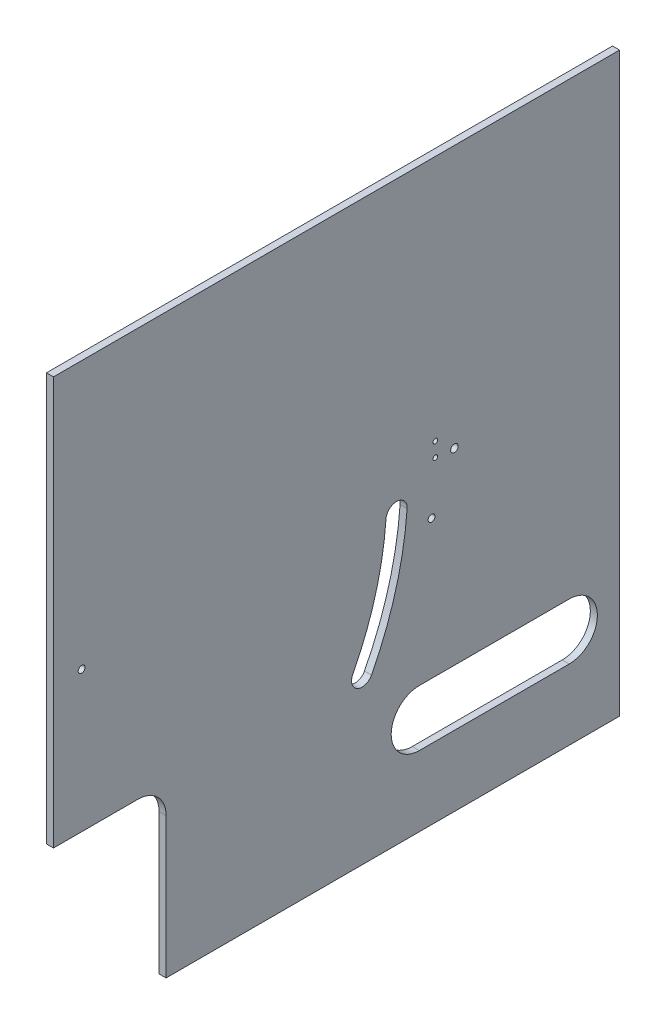
ISO-10303-21;
HEADER;
FILE_DESCRIPTION(('STEP AP214'),'2;1');
FILE_NAME('part.step','',(''),(''),'','','');
FILE_SCHEMA(('AUTOMOTIVE_DESIGN { 1 0 10303 214 1 1 1 1 }'));
ENDSEC;
DATA;
#1=APPLICATION_CONTEXT('core data for automotive mechanical design processes');
#2=APPLICATION_PROTOCOL_DEFINITION('international standard','automotive_design',2000,#1);
#3=PRODUCT_CONTEXT('',#1,'mechanical');
#4=PRODUCT('Part','Part','',(#3));
#5=PRODUCT_RELATED_PRODUCT_CATEGORY('part','',(#4));
#6=PRODUCT_DEFINITION_FORMATION('','',#4);
#7=PRODUCT_DEFINITION_CONTEXT('part definition',#1,'design');
#8=PRODUCT_DEFINITION('design','',#6,#7);
#9=PRODUCT_DEFINITION_SHAPE('','',#8);
#10=(LENGTH_UNIT() NAMED_UNIT(*) SI_UNIT(.MILLI.,.METRE.));
#11=(NAMED_UNIT(*) PLANE_ANGLE_UNIT() SI_UNIT($,.RADIAN.));
#12=(NAMED_UNIT(*) SI_UNIT($,.STERADIAN.) SOLID_ANGLE_UNIT());
#13=UNCERTAINTY_MEASURE_WITH_UNIT(LENGTH_MEASURE(1.E-05),#10,'distance_accuracy_value','');
#14=(GEOMETRIC_REPRESENTATION_CONTEXT(3) GLOBAL_UNCERTAINTY_ASSIGNED_CONTEXT((#13)) GLOBAL_UNIT_ASSIGNED_CONTEXT((#10,
#11,#12)) REPRESENTATION_CONTEXT('',''));
#15=CARTESIAN_POINT('',(0.,0.,0.));
#16=DIRECTION('',(0.,0.,1.));
#17=DIRECTION('',(1.,0.,0.));
#18=AXIS2_PLACEMENT_3D('',#15,#16,#17);
#19=CARTESIAN_POINT('',(3.175,130.175,127.725));
#20=DIRECTION('',(0.,0.,-1.));
#21=DIRECTION('',(-1.,0.,0.));
#22=AXIS2_PLACEMENT_3D('',#19,#20,#21);
#23=PLANE('',#22);
#24=DIRECTION('',(0.,-1.,0.));
#25=VECTOR('',#24,1.);
#26=CARTESIAN_POINT('',(0.,130.175,127.725));
#27=LINE('',#26,#25);
#28=CARTESIAN_POINT('',(0.,130.175,127.725));
#29=VERTEX_POINT('',#28);
#30=CARTESIAN_POINT('',(0.,-53.975,127.725));
#31=VERTEX_POINT('',#30);
#32=EDGE_CURVE('E254',#29,#31,#27,.T.);
#33=ORIENTED_EDGE('',*,*,#32,.T.);
#34=DIRECTION('',(-1.,0.,0.));
#35=VECTOR('',#34,1.);
#36=CARTESIAN_POINT('',(3.175,-53.975,127.725));
#37=LINE('',#36,#35);
#38=CARTESIAN_POINT('',(3.175,-53.975,127.725));
#39=VERTEX_POINT('',#38);
#40=EDGE_CURVE('E184',#39,#31,#37,.T.);
#41=ORIENTED_EDGE('',*,*,#40,.F.);
#42=DIRECTION('',(0.,-1.,0.));
#43=VECTOR('',#42,1.);
#44=CARTESIAN_POINT('',(3.175,130.175,127.725));
#45=LINE('',#44,#43);
#46=CARTESIAN_POINT('',(3.175,130.175,127.725));
#47=VERTEX_POINT('',#46);
#48=EDGE_CURVE('E255',#47,#39,#45,.T.);
#49=ORIENTED_EDGE('',*,*,#48,.F.);
#50=DIRECTION('',(-1.,0.,0.));
#51=VECTOR('',#50,1.);
#52=CARTESIAN_POINT('',(3.175,130.175,127.725));
#53=LINE('',#52,#51);
#54=EDGE_CURVE('E263',#47,#29,#53,.T.);
#55=ORIENTED_EDGE('',*,*,#54,.T.);
#56=EDGE_LOOP('',(#33,#41,#49,#55));
#57=FACE_BOUND('',#56,.T.);
#58=ADVANCED_FACE('F35',(#57),#23,.F.);
#59=CARTESIAN_POINT('',(3.175,-130.175,127.725));
#60=DIRECTION('',(0.,1.,0.));
#61=DIRECTION('',(0.,0.,1.));
#62=AXIS2_PLACEMENT_3D('',#59,#60,#61);
#63=PLANE('',#62);
#64=DIRECTION('',(0.,0.,-1.));
#65=VECTOR('',#64,1.);
#66=CARTESIAN_POINT('',(3.175,-130.175,127.725));
#67=LINE('',#66,#65);
#68=CARTESIAN_POINT('',(3.175,-130.175,76.9250000000001));
#69=VERTEX_POINT('',#68);
#70=CARTESIAN_POINT('',(3.175,-130.175,-127.725));
#71=VERTEX_POINT('',#70);
#72=EDGE_CURVE('E258',#69,#71,#67,.T.);
#73=ORIENTED_EDGE('',*,*,#72,.F.);
#74=DIRECTION('',(-1.,0.,0.));
#75=VECTOR('',#74,1.);
#76=CARTESIAN_POINT('',(3.175,-130.175,76.9250000000001));
#77=LINE('',#76,#75);
#78=CARTESIAN_POINT('',(0.,-130.175,76.9250000000001));
#79=VERTEX_POINT('',#78);
#80=EDGE_CURVE('E188',#69,#79,#77,.T.);
#81=ORIENTED_EDGE('',*,*,#80,.T.);
#82=DIRECTION('',(0.,0.,-1.));
#83=VECTOR('',#82,1.);
#84=CARTESIAN_POINT('',(0.,-130.175,127.725));
#85=LINE('',#84,#83);
#86=CARTESIAN_POINT('',(0.,-130.175,-127.725));
#87=VERTEX_POINT('',#86);
#88=EDGE_CURVE('E266',#79,#87,#85,.T.);
#89=ORIENTED_EDGE('',*,*,#88,.T.);
#90=DIRECTION('',(-1.,0.,0.));
#91=VECTOR('',#90,1.);
#92=CARTESIAN_POINT('',(3.175,-130.175,-127.725));
#93=LINE('',#92,#91);
#94=EDGE_CURVE('E276',#71,#87,#93,.T.);
#95=ORIENTED_EDGE('',*,*,#94,.F.);
#96=EDGE_LOOP('',(#73,#81,#89,#95));
#97=FACE_BOUND('',#96,.T.);
#98=ADVANCED_FACE('F304',(#97),#63,.F.);
#99=CARTESIAN_POINT('',(3.175,130.175,-127.725));
#100=DIRECTION('',(0.,0.,1.));
#101=DIRECTION('',(0.,-1.,0.));
#102=AXIS2_PLACEMENT_3D('',#99,#100,#101);
#103=PLANE('',#102);
#104=DIRECTION('',(-1.,0.,0.));
#105=VECTOR('',#104,1.);
#106=CARTESIAN_POINT('',(3.175,130.175,-127.725));
#107=LINE('',#106,#105);
#108=CARTESIAN_POINT('',(3.175,130.175,-127.725));
#109=VERTEX_POINT('',#108);
#110=CARTESIAN_POINT('',(0.,130.175,-127.725));
#111=VERTEX_POINT('',#110);
#112=EDGE_CURVE('E274',#109,#111,#107,.T.);
#113=ORIENTED_EDGE('',*,*,#112,.F.);
#114=DIRECTION('',(0.,1.,0.));
#115=VECTOR('',#114,1.);
#116=CARTESIAN_POINT('',(3.175,130.175,-127.725));
#117=LINE('',#116,#115);
#118=EDGE_CURVE('E261',#71,#109,#117,.T.);
#119=ORIENTED_EDGE('',*,*,#118,.F.);
#120=ORIENTED_EDGE('',*,*,#94,.T.);
#121=DIRECTION('',(0.,1.,0.));
#122=VECTOR('',#121,1.);
#123=CARTESIAN_POINT('',(0.,130.175,-127.725));
#124=LINE('',#123,#122);
#125=EDGE_CURVE('E268',#87,#111,#124,.T.);
#126=ORIENTED_EDGE('',*,*,#125,.T.);
#127=EDGE_LOOP('',(#113,#119,#120,#126));
#128=FACE_BOUND('',#127,.T.);
#129=ADVANCED_FACE('F312',(#128),#103,.F.);
#130=CARTESIAN_POINT('',(3.175,130.175,127.725));
#131=DIRECTION('',(0.,-1.,0.));
#132=DIRECTION('',(0.,0.,-1.));
#133=AXIS2_PLACEMENT_3D('',#130,#131,#132);
#134=PLANE('',#133);
#135=ORIENTED_EDGE('',*,*,#54,.F.);
#136=DIRECTION('',(0.,0.,-1.));
#137=VECTOR('',#136,1.);
#138=CARTESIAN_POINT('',(3.175,130.175,127.725));
#139=LINE('',#138,#137);
#140=EDGE_CURVE('E196',#47,#109,#139,.T.);
#141=ORIENTED_EDGE('',*,*,#140,.T.);
#142=ORIENTED_EDGE('',*,*,#112,.T.);
#143=DIRECTION('',(0.,0.,1.));
#144=VECTOR('',#143,1.);
#145=CARTESIAN_POINT('',(0.,130.175,127.725));
#146=LINE('',#145,#144);
#147=EDGE_CURVE('E259',#111,#29,#146,.T.);
#148=ORIENTED_EDGE('',*,*,#147,.T.);
#149=EDGE_LOOP('',(#135,#141,#142,#148));
#150=FACE_BOUND('',#149,.T.);
#151=ADVANCED_FACE('F311',(#150),#134,.F.);
#152=CARTESIAN_POINT('',(3.175,0.,0.));
#153=DIRECTION('',(1.,0.,0.));
#154=DIRECTION('',(0.,0.,-1.));
#155=AXIS2_PLACEMENT_3D('',#152,#153,#154);
#156=PLANE('',#155);
#157=CARTESIAN_POINT('',(3.175,9.52500000000001,115.025));
#158=DIRECTION('',(-1.,0.,0.));
#159=DIRECTION('',(0.,0.,1.));
#160=AXIS2_PLACEMENT_3D('',#157,#158,#159);
#161=CIRCLE('',#160,147.274915375813);
#162=CARTESIAN_POINT('',(3.175,-1.08849419113548,-31.8669822182528));
#163=VERTEX_POINT('',#162);
#164=CARTESIAN_POINT('',(3.175,-58.1270794828527,-15.792035743051));
#165=VERTEX_POINT('',#164);
#166=EDGE_CURVE('E143',#163,#165,#161,.T.);
#167=ORIENTED_EDGE('',*,*,#166,.T.);
#168=CARTESIAN_POINT('',(3.175,-55.9336784294285,-11.5507141724795));
#169=DIRECTION('',(-1.,0.,0.));
#170=DIRECTION('',(0.,0.,1.));
#171=AXIS2_PLACEMENT_3D('',#168,#169,#170);
#172=CIRCLE('',#171,4.77491537581112);
#173=CARTESIAN_POINT('',(3.175,-53.7402773760043,-7.30939260190796));
#174=VERTEX_POINT('',#173);
#175=EDGE_CURVE('E152',#165,#174,#172,.T.);
#176=ORIENTED_EDGE('',*,*,#175,.T.);
#177=CARTESIAN_POINT('',(3.175,9.52500000000001,115.025));
#178=DIRECTION('',(1.,0.,0.));
#179=DIRECTION('',(0.,0.,1.));
#180=AXIS2_PLACEMENT_3D('',#177,#178,#179);
#181=CIRCLE('',#180,137.725084624191);
#182=CARTESIAN_POINT('',(3.175,-0.400277376004277,-22.341982218253));
#183=VERTEX_POINT('',#182);
#184=EDGE_CURVE('E50',#174,#183,#181,.T.);
#185=ORIENTED_EDGE('',*,*,#184,.T.);
#186=CARTESIAN_POINT('',(3.175,-0.744385783569874,-27.1044822182528));
#187=DIRECTION('',(-1.,0.,0.));
#188=DIRECTION('',(0.,0.,1.));
#189=AXIS2_PLACEMENT_3D('',#186,#187,#188);
#190=CIRCLE('',#189,4.77491537581111);
#191=EDGE_CURVE('E149',#183,#163,#190,.T.);
#192=ORIENTED_EDGE('',*,*,#191,.T.);
#193=EDGE_LOOP('',(#167,#176,#185,#192));
#194=FACE_BOUND('',#193,.T.);
#195=DIRECTION('',(0.,0.,-1.));
#196=VECTOR('',#195,1.);
#197=CARTESIAN_POINT('',(3.175,-53.975,127.725));
#198=LINE('',#197,#196);
#199=CARTESIAN_POINT('',(3.175,-53.975,89.625));
#200=VERTEX_POINT('',#199);
#201=EDGE_CURVE('E178',#39,#200,#198,.T.);
#202=ORIENTED_EDGE('',*,*,#201,.T.);
#203=CARTESIAN_POINT('',(3.175,-66.675,89.625));
#204=DIRECTION('',(1.,0.,0.));
#205=DIRECTION('',(0.,0.,-1.));
#206=AXIS2_PLACEMENT_3D('',#203,#204,#205);
#207=CIRCLE('',#206,12.7);
#208=CARTESIAN_POINT('',(3.175,-66.675,76.925));
#209=VERTEX_POINT('',#208);
#210=EDGE_CURVE('E11',#200,#209,#207,.F.);
#211=ORIENTED_EDGE('',*,*,#210,.T.);
#212=DIRECTION('',(0.,-1.,0.));
#213=VECTOR('',#212,1.);
#214=CARTESIAN_POINT('',(3.175,-53.975,76.925));
#215=LINE('',#214,#213);
#216=EDGE_CURVE('E181',#209,#69,#215,.T.);
#217=ORIENTED_EDGE('',*,*,#216,.T.);
#218=ORIENTED_EDGE('',*,*,#72,.T.);
#219=ORIENTED_EDGE('',*,*,#118,.T.);
#220=ORIENTED_EDGE('',*,*,#140,.F.);
#221=ORIENTED_EDGE('',*,*,#48,.T.);
#222=EDGE_LOOP('',(#202,#211,#217,#218,#219,#220,#221));
#223=FACE_BOUND('',#222,.T.);
#224=CARTESIAN_POINT('',(3.175,9.52500000000001,115.025));
#225=DIRECTION('',(-1.,0.,0.));
#226=DIRECTION('',(0.,0.,1.));
#227=AXIS2_PLACEMENT_3D('',#224,#225,#226);
#228=CIRCLE('',#227,1.54999999999999);
#229=CARTESIAN_POINT('',(3.175,9.52500000000001,116.575));
#230=VERTEX_POINT('',#229);
#231=EDGE_CURVE('E193',#230,#230,#228,.T.);
#232=ORIENTED_EDGE('',*,*,#231,.T.);
#233=EDGE_LOOP('',(#232));
#234=FACE_BOUND('',#233,.T.);
#235=CARTESIAN_POINT('',(3.175,-10.375,-42.9049952));
#236=DIRECTION('',(-1.,0.,0.));
#237=DIRECTION('',(0.,0.,1.));
#238=AXIS2_PLACEMENT_3D('',#235,#236,#237);
#239=CIRCLE('',#238,1.54999689999999);
#240=CARTESIAN_POINT('',(3.175,-10.375,-41.3549983));
#241=VERTEX_POINT('',#240);
#242=EDGE_CURVE('E208',#241,#241,#239,.T.);
#243=ORIENTED_EDGE('',*,*,#242,.T.);
#244=EDGE_LOOP('',(#243));
#245=FACE_BOUND('',#244,.T.);
#246=CARTESIAN_POINT('',(3.175,11.825,-53.205));
#247=DIRECTION('',(-1.,0.,0.));
#248=DIRECTION('',(0.,0.,1.));
#249=AXIS2_PLACEMENT_3D('',#246,#247,#248);
#250=CIRCLE('',#249,1.69999660000001);
#251=CARTESIAN_POINT('',(3.175,11.825,-51.5050033999999));
#252=VERTEX_POINT('',#251);
#253=EDGE_CURVE('E201',#252,#252,#250,.T.);
#254=ORIENTED_EDGE('',*,*,#253,.T.);
#255=EDGE_LOOP('',(#254));
#256=FACE_BOUND('',#255,.T.);
#257=CARTESIAN_POINT('',(3.175,12.425,-44.6049999999999));
#258=DIRECTION('',(-1.,0.,0.));
#259=DIRECTION('',(0.,0.,1.));
#260=AXIS2_PLACEMENT_3D('',#257,#258,#259);
#261=CIRCLE('',#260,1.05);
#262=CARTESIAN_POINT('',(3.175,12.425,-43.5549999999999));
#263=VERTEX_POINT('',#262);
#264=EDGE_CURVE('E218',#263,#263,#261,.T.);
#265=ORIENTED_EDGE('',*,*,#264,.T.);
#266=EDGE_LOOP('',(#265));
#267=FACE_BOUND('',#266,.T.);
#268=CARTESIAN_POINT('',(3.175,18.925,-44.605));
#269=DIRECTION('',(-1.,0.,0.));
#270=DIRECTION('',(0.,0.,1.));
#271=AXIS2_PLACEMENT_3D('',#268,#269,#270);
#272=CIRCLE('',#271,1.05);
#273=CARTESIAN_POINT('',(3.175,18.925,-43.555));
#274=VERTEX_POINT('',#273);
#275=EDGE_CURVE('E200',#274,#274,#272,.T.);
#276=ORIENTED_EDGE('',*,*,#275,.T.);
#277=EDGE_LOOP('',(#276));
#278=FACE_BOUND('',#277,.T.);
#279=CARTESIAN_POINT('',(3.175,-85.725,-105.025));
#280=DIRECTION('',(1.,0.,0.));
#281=DIRECTION('',(0.,0.,-1.));
#282=AXIS2_PLACEMENT_3D('',#279,#280,#281);
#283=CIRCLE('',#282,12.7);
#284=CARTESIAN_POINT('',(3.175,-98.425,-105.025));
#285=VERTEX_POINT('',#284);
#286=CARTESIAN_POINT('',(3.175,-73.025,-105.025));
#287=VERTEX_POINT('',#286);
#288=EDGE_CURVE('E252',#285,#287,#283,.T.);
#289=ORIENTED_EDGE('',*,*,#288,.F.);
#290=DIRECTION('',(0.,0.,-1.));
#291=VECTOR('',#290,1.);
#292=CARTESIAN_POINT('',(3.175,-98.425,0.));
#293=LINE('',#292,#291);
#294=CARTESIAN_POINT('',(3.175,-98.425,-37.3749999999999));
#295=VERTEX_POINT('',#294);
#296=EDGE_CURVE('E239',#295,#285,#293,.T.);
#297=ORIENTED_EDGE('',*,*,#296,.F.);
#298=CARTESIAN_POINT('',(3.175,-85.725,-37.3749999999999));
#299=DIRECTION('',(1.,0.,0.));
#300=DIRECTION('',(0.,0.,-1.));
#301=AXIS2_PLACEMENT_3D('',#298,#299,#300);
#302=CIRCLE('',#301,12.7);
#303=CARTESIAN_POINT('',(3.175,-73.025,-37.3749999999999));
#304=VERTEX_POINT('',#303);
#305=EDGE_CURVE('E247',#304,#295,#302,.T.);
#306=ORIENTED_EDGE('',*,*,#305,.F.);
#307=DIRECTION('',(0.,0.,1.));
#308=VECTOR('',#307,1.);
#309=CARTESIAN_POINT('',(3.175,-73.025,0.));
#310=LINE('',#309,#308);
#311=EDGE_CURVE('E250',#287,#304,#310,.T.);
#312=ORIENTED_EDGE('',*,*,#311,.F.);
#313=EDGE_LOOP('',(#289,#297,#306,#312));
#314=FACE_BOUND('',#313,.T.);
#315=ADVANCED_FACE('F156',(#194,#223,#234,#245,#256,#267,#278,#314),#156,.T.);
#316=CARTESIAN_POINT('',(0.,0.,0.));
#317=DIRECTION('',(1.,0.,0.));
#318=DIRECTION('',(0.,0.,-1.));
#319=AXIS2_PLACEMENT_3D('',#316,#317,#318);
#320=PLANE('',#319);
#321=CARTESIAN_POINT('',(0.,-55.9336784294285,-11.5507141724795));
#322=DIRECTION('',(-1.,0.,0.));
#323=DIRECTION('',(0.,0.,1.));
#324=AXIS2_PLACEMENT_3D('',#321,#322,#323);
#325=CIRCLE('',#324,4.77491537581112);
#326=CARTESIAN_POINT('',(0.,-58.1270794828527,-15.792035743051));
#327=VERTEX_POINT('',#326);
#328=CARTESIAN_POINT('',(0.,-53.7402773760043,-7.30939260190796));
#329=VERTEX_POINT('',#328);
#330=EDGE_CURVE('E168',#327,#329,#325,.T.);
#331=ORIENTED_EDGE('',*,*,#330,.F.);
#332=CARTESIAN_POINT('',(0.,9.52500000000001,115.025));
#333=DIRECTION('',(-1.,0.,0.));
#334=DIRECTION('',(0.,0.,1.));
#335=AXIS2_PLACEMENT_3D('',#332,#333,#334);
#336=CIRCLE('',#335,147.274915375813);
#337=CARTESIAN_POINT('',(0.,-1.08849419113548,-31.8669822182528));
#338=VERTEX_POINT('',#337);
#339=EDGE_CURVE('E58',#338,#327,#336,.T.);
#340=ORIENTED_EDGE('',*,*,#339,.F.);
#341=CARTESIAN_POINT('',(0.,-0.744385783569874,-27.1044822182528));
#342=DIRECTION('',(-1.,0.,0.));
#343=DIRECTION('',(0.,0.,1.));
#344=AXIS2_PLACEMENT_3D('',#341,#342,#343);
#345=CIRCLE('',#344,4.77491537581111);
#346=CARTESIAN_POINT('',(0.,-0.400277376004277,-22.341982218253));
#347=VERTEX_POINT('',#346);
#348=EDGE_CURVE('E159',#347,#338,#345,.T.);
#349=ORIENTED_EDGE('',*,*,#348,.F.);
#350=CARTESIAN_POINT('',(0.,9.52500000000001,115.025));
#351=DIRECTION('',(1.,0.,0.));
#352=DIRECTION('',(0.,0.,1.));
#353=AXIS2_PLACEMENT_3D('',#350,#351,#352);
#354=CIRCLE('',#353,137.725084624191);
#355=EDGE_CURVE('E162',#329,#347,#354,.T.);
#356=ORIENTED_EDGE('',*,*,#355,.F.);
#357=EDGE_LOOP('',(#331,#340,#349,#356));
#358=FACE_BOUND('',#357,.T.);
#359=CARTESIAN_POINT('',(0.,9.52500000000001,115.025));
#360=DIRECTION('',(-1.,0.,0.));
#361=DIRECTION('',(0.,0.,1.));
#362=AXIS2_PLACEMENT_3D('',#359,#360,#361);
#363=CIRCLE('',#362,1.54999999999999);
#364=CARTESIAN_POINT('',(0.,9.52500000000001,116.575));
#365=VERTEX_POINT('',#364);
#366=EDGE_CURVE('E197',#365,#365,#363,.T.);
#367=ORIENTED_EDGE('',*,*,#366,.F.);
#368=EDGE_LOOP('',(#367));
#369=FACE_BOUND('',#368,.T.);
#370=CARTESIAN_POINT('',(0.,-10.375,-42.9049952));
#371=DIRECTION('',(-1.,0.,0.));
#372=DIRECTION('',(0.,0.,1.));
#373=AXIS2_PLACEMENT_3D('',#370,#371,#372);
#374=CIRCLE('',#373,1.54999689999999);
#375=CARTESIAN_POINT('',(0.,-10.375,-41.3549983));
#376=VERTEX_POINT('',#375);
#377=EDGE_CURVE('E191',#376,#376,#374,.T.);
#378=ORIENTED_EDGE('',*,*,#377,.F.);
#379=EDGE_LOOP('',(#378));
#380=FACE_BOUND('',#379,.T.);
#381=CARTESIAN_POINT('',(0.,11.825,-53.205));
#382=DIRECTION('',(-1.,0.,0.));
#383=DIRECTION('',(0.,0.,1.));
#384=AXIS2_PLACEMENT_3D('',#381,#382,#383);
#385=CIRCLE('',#384,1.69999660000001);
#386=CARTESIAN_POINT('',(0.,11.825,-51.5050033999999));
#387=VERTEX_POINT('',#386);
#388=EDGE_CURVE('E205',#387,#387,#385,.T.);
#389=ORIENTED_EDGE('',*,*,#388,.F.);
#390=EDGE_LOOP('',(#389));
#391=FACE_BOUND('',#390,.T.);
#392=CARTESIAN_POINT('',(0.,12.425,-44.6049999999999));
#393=DIRECTION('',(-1.,0.,0.));
#394=DIRECTION('',(0.,0.,1.));
#395=AXIS2_PLACEMENT_3D('',#392,#393,#394);
#396=CIRCLE('',#395,1.05);
#397=CARTESIAN_POINT('',(0.,12.425,-43.5549999999999));
#398=VERTEX_POINT('',#397);
#399=EDGE_CURVE('E204',#398,#398,#396,.T.);
#400=ORIENTED_EDGE('',*,*,#399,.F.);
#401=EDGE_LOOP('',(#400));
#402=FACE_BOUND('',#401,.T.);
#403=CARTESIAN_POINT('',(0.,18.925,-44.605));
#404=DIRECTION('',(-1.,0.,0.));
#405=DIRECTION('',(0.,0.,1.));
#406=AXIS2_PLACEMENT_3D('',#403,#404,#405);
#407=CIRCLE('',#406,1.05);
#408=CARTESIAN_POINT('',(0.,18.925,-43.555));
#409=VERTEX_POINT('',#408);
#410=EDGE_CURVE('E215',#409,#409,#407,.T.);
#411=ORIENTED_EDGE('',*,*,#410,.F.);
#412=EDGE_LOOP('',(#411));
#413=FACE_BOUND('',#412,.T.);
#414=DIRECTION('',(0.,0.,1.));
#415=VECTOR('',#414,1.);
#416=CARTESIAN_POINT('',(0.,-98.425,-37.3749999999999));
#417=LINE('',#416,#415);
#418=CARTESIAN_POINT('',(0.,-98.425,-105.025));
#419=VERTEX_POINT('',#418);
#420=CARTESIAN_POINT('',(0.,-98.425,-37.3749999999999));
#421=VERTEX_POINT('',#420);
#422=EDGE_CURVE('E227',#419,#421,#417,.T.);
#423=ORIENTED_EDGE('',*,*,#422,.F.);
#424=CARTESIAN_POINT('',(0.,-85.725,-105.025));
#425=DIRECTION('',(-1.,0.,0.));
#426=DIRECTION('',(0.,0.,-1.));
#427=AXIS2_PLACEMENT_3D('',#424,#425,#426);
#428=CIRCLE('',#427,12.7);
#429=CARTESIAN_POINT('',(0.,-73.025,-105.025));
#430=VERTEX_POINT('',#429);
#431=EDGE_CURVE('E225',#430,#419,#428,.T.);
#432=ORIENTED_EDGE('',*,*,#431,.F.);
#433=DIRECTION('',(0.,0.,-1.));
#434=VECTOR('',#433,1.);
#435=CARTESIAN_POINT('',(0.,-73.025,-105.025));
#436=LINE('',#435,#434);
#437=CARTESIAN_POINT('',(0.,-73.025,-37.3749999999999));
#438=VERTEX_POINT('',#437);
#439=EDGE_CURVE('E233',#438,#430,#436,.T.);
#440=ORIENTED_EDGE('',*,*,#439,.F.);
#441=CARTESIAN_POINT('',(0.,-85.725,-37.3749999999999));
#442=DIRECTION('',(-1.,0.,0.));
#443=DIRECTION('',(0.,0.,-1.));
#444=AXIS2_PLACEMENT_3D('',#441,#442,#443);
#445=CIRCLE('',#444,12.7);
#446=EDGE_CURVE('E230',#421,#438,#445,.T.);
#447=ORIENTED_EDGE('',*,*,#446,.F.);
#448=EDGE_LOOP('',(#423,#432,#440,#447));
#449=FACE_BOUND('',#448,.T.);
#450=ORIENTED_EDGE('',*,*,#88,.F.);
#451=DIRECTION('',(0.,-1.,0.));
#452=VECTOR('',#451,1.);
#453=CARTESIAN_POINT('',(0.,-53.975,76.925));
#454=LINE('',#453,#452);
#455=CARTESIAN_POINT('',(0.,-66.675,76.925));
#456=VERTEX_POINT('',#455);
#457=EDGE_CURVE('E182',#456,#79,#454,.T.);
#458=ORIENTED_EDGE('',*,*,#457,.F.);
#459=CARTESIAN_POINT('',(0.,-66.675,89.625));
#460=DIRECTION('',(1.,0.,0.));
#461=DIRECTION('',(0.,0.,-1.));
#462=AXIS2_PLACEMENT_3D('',#459,#460,#461);
#463=CIRCLE('',#462,12.7);
#464=CARTESIAN_POINT('',(0.,-53.975,89.625));
#465=VERTEX_POINT('',#464);
#466=EDGE_CURVE('E43',#456,#465,#463,.T.);
#467=ORIENTED_EDGE('',*,*,#466,.T.);
#468=DIRECTION('',(0.,0.,-1.));
#469=VECTOR('',#468,1.);
#470=CARTESIAN_POINT('',(0.,-53.975,127.725));
#471=LINE('',#470,#469);
#472=EDGE_CURVE('E174',#31,#465,#471,.T.);
#473=ORIENTED_EDGE('',*,*,#472,.F.);
#474=ORIENTED_EDGE('',*,*,#32,.F.);
#475=ORIENTED_EDGE('',*,*,#147,.F.);
#476=ORIENTED_EDGE('',*,*,#125,.F.);
#477=EDGE_LOOP('',(#450,#458,#467,#473,#474,#475,#476));
#478=FACE_BOUND('',#477,.T.);
#479=ADVANCED_FACE('F287',(#358,#369,#380,#391,#402,#413,#449,#478),#320,.F.);
#480=CARTESIAN_POINT('',(15.875,-85.725,-105.025));
#481=DIRECTION('',(-1.,0.,0.));
#482=DIRECTION('',(0.,0.,1.));
#483=AXIS2_PLACEMENT_3D('',#480,#481,#482);
#484=CYLINDRICAL_SURFACE('',#483,12.7);
#485=ORIENTED_EDGE('',*,*,#288,.T.);
#486=DIRECTION('',(-1.,0.,0.));
#487=VECTOR('',#486,1.);
#488=CARTESIAN_POINT('',(15.875,-73.025,-105.025));
#489=LINE('',#488,#487);
#490=EDGE_CURVE('E237',#287,#430,#489,.T.);
#491=ORIENTED_EDGE('',*,*,#490,.T.);
#492=ORIENTED_EDGE('',*,*,#431,.T.);
#493=DIRECTION('',(-1.,0.,0.));
#494=VECTOR('',#493,1.);
#495=CARTESIAN_POINT('',(15.875,-98.425,-105.025));
#496=LINE('',#495,#494);
#497=EDGE_CURVE('E236',#285,#419,#496,.T.);
#498=ORIENTED_EDGE('',*,*,#497,.F.);
#499=EDGE_LOOP('',(#485,#491,#492,#498));
#500=FACE_BOUND('',#499,.T.);
#501=ADVANCED_FACE('F328',(#500),#484,.F.);
#502=CARTESIAN_POINT('',(15.875,-73.025,-105.025));
#503=DIRECTION('',(0.,1.,0.));
#504=DIRECTION('',(0.,0.,1.));
#505=AXIS2_PLACEMENT_3D('',#502,#503,#504);
#506=PLANE('',#505);
#507=ORIENTED_EDGE('',*,*,#311,.T.);
#508=DIRECTION('',(-1.,0.,0.));
#509=VECTOR('',#508,1.);
#510=CARTESIAN_POINT('',(15.875,-73.025,-37.3749999999999));
#511=LINE('',#510,#509);
#512=EDGE_CURVE('E240',#304,#438,#511,.T.);
#513=ORIENTED_EDGE('',*,*,#512,.T.);
#514=ORIENTED_EDGE('',*,*,#439,.T.);
#515=ORIENTED_EDGE('',*,*,#490,.F.);
#516=EDGE_LOOP('',(#507,#513,#514,#515));
#517=FACE_BOUND('',#516,.T.);
#518=ADVANCED_FACE('F334',(#517),#506,.F.);
#519=CARTESIAN_POINT('',(15.875,-85.725,-37.3749999999999));
#520=DIRECTION('',(-1.,0.,0.));
#521=DIRECTION('',(0.,0.,1.));
#522=AXIS2_PLACEMENT_3D('',#519,#520,#521);
#523=CYLINDRICAL_SURFACE('',#522,12.7);
#524=ORIENTED_EDGE('',*,*,#305,.T.);
#525=DIRECTION('',(-1.,0.,0.));
#526=VECTOR('',#525,1.);
#527=CARTESIAN_POINT('',(15.875,-98.425,-37.3749999999999));
#528=LINE('',#527,#526);
#529=EDGE_CURVE('E242',#295,#421,#528,.T.);
#530=ORIENTED_EDGE('',*,*,#529,.T.);
#531=ORIENTED_EDGE('',*,*,#446,.T.);
#532=ORIENTED_EDGE('',*,*,#512,.F.);
#533=EDGE_LOOP('',(#524,#530,#531,#532));
#534=FACE_BOUND('',#533,.T.);
#535=ADVANCED_FACE('F340',(#534),#523,.F.);
#536=CARTESIAN_POINT('',(15.875,-98.425,-37.3749999999999));
#537=DIRECTION('',(0.,-1.,0.));
#538=DIRECTION('',(0.,0.,-1.));
#539=AXIS2_PLACEMENT_3D('',#536,#537,#538);
#540=PLANE('',#539);
#541=ORIENTED_EDGE('',*,*,#296,.T.);
#542=ORIENTED_EDGE('',*,*,#497,.T.);
#543=ORIENTED_EDGE('',*,*,#422,.T.);
#544=ORIENTED_EDGE('',*,*,#529,.F.);
#545=EDGE_LOOP('',(#541,#542,#543,#544));
#546=FACE_BOUND('',#545,.T.);
#547=ADVANCED_FACE('F336',(#546),#540,.F.);
#548=CARTESIAN_POINT('',(3.175,18.925,-44.605));
#549=DIRECTION('',(-1.,0.,0.));
#550=DIRECTION('',(0.,0.,1.));
#551=AXIS2_PLACEMENT_3D('',#548,#549,#550);
#552=CYLINDRICAL_SURFACE('',#551,1.05);
#553=ORIENTED_EDGE('',*,*,#275,.F.);
#554=EDGE_LOOP('',(#553));
#555=FACE_BOUND('',#554,.T.);
#556=ORIENTED_EDGE('',*,*,#410,.T.);
#557=EDGE_LOOP('',(#556));
#558=FACE_BOUND('',#557,.T.);
#559=ADVANCED_FACE('F339',(#555,#558),#552,.F.);
#560=CARTESIAN_POINT('',(3.175,12.425,-44.6049999999999));
#561=DIRECTION('',(-1.,0.,0.));
#562=DIRECTION('',(0.,0.,1.));
#563=AXIS2_PLACEMENT_3D('',#560,#561,#562);
#564=CYLINDRICAL_SURFACE('',#563,1.05);
#565=ORIENTED_EDGE('',*,*,#264,.F.);
#566=EDGE_LOOP('',(#565));
#567=FACE_BOUND('',#566,.T.);
#568=ORIENTED_EDGE('',*,*,#399,.T.);
#569=EDGE_LOOP('',(#568));
#570=FACE_BOUND('',#569,.T.);
#571=ADVANCED_FACE('F348',(#567,#570),#564,.F.);
#572=CARTESIAN_POINT('',(3.175,11.825,-53.205));
#573=DIRECTION('',(-1.,0.,0.));
#574=DIRECTION('',(0.,0.,1.));
#575=AXIS2_PLACEMENT_3D('',#572,#573,#574);
#576=CYLINDRICAL_SURFACE('',#575,1.69999660000001);
#577=ORIENTED_EDGE('',*,*,#253,.F.);
#578=EDGE_LOOP('',(#577));
#579=FACE_BOUND('',#578,.T.);
#580=ORIENTED_EDGE('',*,*,#388,.T.);
#581=EDGE_LOOP('',(#580));
#582=FACE_BOUND('',#581,.T.);
#583=ADVANCED_FACE('F351',(#579,#582),#576,.F.);
#584=CARTESIAN_POINT('',(3.175,-10.375,-42.9049952));
#585=DIRECTION('',(-1.,0.,0.));
#586=DIRECTION('',(0.,0.,1.));
#587=AXIS2_PLACEMENT_3D('',#584,#585,#586);
#588=CYLINDRICAL_SURFACE('',#587,1.54999689999999);
#589=ORIENTED_EDGE('',*,*,#242,.F.);
#590=EDGE_LOOP('',(#589));
#591=FACE_BOUND('',#590,.T.);
#592=ORIENTED_EDGE('',*,*,#377,.T.);
#593=EDGE_LOOP('',(#592));
#594=FACE_BOUND('',#593,.T.);
#595=ADVANCED_FACE('F356',(#591,#594),#588,.F.);
#596=CARTESIAN_POINT('',(3.175,9.52500000000001,115.025));
#597=DIRECTION('',(-1.,0.,0.));
#598=DIRECTION('',(0.,0.,1.));
#599=AXIS2_PLACEMENT_3D('',#596,#597,#598);
#600=CYLINDRICAL_SURFACE('',#599,1.54999999999999);
#601=ORIENTED_EDGE('',*,*,#231,.F.);
#602=EDGE_LOOP('',(#601));
#603=FACE_BOUND('',#602,.T.);
#604=ORIENTED_EDGE('',*,*,#366,.T.);
#605=EDGE_LOOP('',(#604));
#606=FACE_BOUND('',#605,.T.);
#607=ADVANCED_FACE('F359',(#603,#606),#600,.F.);
#608=CARTESIAN_POINT('',(3.175,-53.975,76.925));
#609=DIRECTION('',(0.,0.,-1.));
#610=DIRECTION('',(0.,1.,0.));
#611=AXIS2_PLACEMENT_3D('',#608,#609,#610);
#612=PLANE('',#611);
#613=ORIENTED_EDGE('',*,*,#216,.F.);
#614=DIRECTION('',(-1.,0.,0.));
#615=VECTOR('',#614,1.);
#616=CARTESIAN_POINT('',(0.,-66.675,76.925));
#617=LINE('',#616,#615);
#618=EDGE_CURVE('E279',#209,#456,#617,.T.);
#619=ORIENTED_EDGE('',*,*,#618,.T.);
#620=ORIENTED_EDGE('',*,*,#457,.T.);
#621=ORIENTED_EDGE('',*,*,#80,.F.);
#622=EDGE_LOOP('',(#613,#619,#620,#621));
#623=FACE_BOUND('',#622,.T.);
#624=ADVANCED_FACE('F300',(#623),#612,.F.);
#625=CARTESIAN_POINT('',(3.175,-53.975,127.725));
#626=DIRECTION('',(0.,1.,0.));
#627=DIRECTION('',(0.,0.,1.));
#628=AXIS2_PLACEMENT_3D('',#625,#626,#627);
#629=PLANE('',#628);
#630=ORIENTED_EDGE('',*,*,#472,.T.);
#631=DIRECTION('',(-1.,0.,0.));
#632=VECTOR('',#631,1.);
#633=CARTESIAN_POINT('',(3.175,-53.975,89.625));
#634=LINE('',#633,#632);
#635=EDGE_CURVE('E282',#465,#200,#634,.F.);
#636=ORIENTED_EDGE('',*,*,#635,.T.);
#637=ORIENTED_EDGE('',*,*,#201,.F.);
#638=ORIENTED_EDGE('',*,*,#40,.T.);
#639=EDGE_LOOP('',(#630,#636,#637,#638));
#640=FACE_BOUND('',#639,.T.);
#641=ADVANCED_FACE('F293',(#640),#629,.F.);
#642=CARTESIAN_POINT('',(3.175,-66.675,89.625));
#643=DIRECTION('',(1.,0.,0.));
#644=DIRECTION('',(0.,0.,-1.));
#645=AXIS2_PLACEMENT_3D('',#642,#643,#644);
#646=CYLINDRICAL_SURFACE('',#645,12.7);
#647=ORIENTED_EDGE('',*,*,#210,.F.);
#648=ORIENTED_EDGE('',*,*,#635,.F.);
#649=ORIENTED_EDGE('',*,*,#466,.F.);
#650=ORIENTED_EDGE('',*,*,#618,.F.);
#651=EDGE_LOOP('',(#647,#648,#649,#650));
#652=FACE_BOUND('',#651,.T.);
#653=ADVANCED_FACE('F37',(#652),#646,.F.);
#654=CARTESIAN_POINT('',(3.175,9.52500000000001,115.025));
#655=DIRECTION('',(-1.,0.,0.));
#656=DIRECTION('',(0.,0.,1.));
#657=AXIS2_PLACEMENT_3D('',#654,#655,#656);
#658=CYLINDRICAL_SURFACE('',#657,147.274915375813);
#659=ORIENTED_EDGE('',*,*,#339,.T.);
#660=DIRECTION('',(-1.,0.,0.));
#661=VECTOR('',#660,1.);
#662=CARTESIAN_POINT('',(3.175,-58.1270794828527,-15.792035743051));
#663=LINE('',#662,#661);
#664=EDGE_CURVE('E139',#165,#327,#663,.T.);
#665=ORIENTED_EDGE('',*,*,#664,.F.);
#666=ORIENTED_EDGE('',*,*,#166,.F.);
#667=DIRECTION('',(-1.,0.,0.));
#668=VECTOR('',#667,1.);
#669=CARTESIAN_POINT('',(3.175,-1.08849419113548,-31.8669822182528));
#670=LINE('',#669,#668);
#671=EDGE_CURVE('E172',#163,#338,#670,.T.);
#672=ORIENTED_EDGE('',*,*,#671,.T.);
#673=EDGE_LOOP('',(#659,#665,#666,#672));
#674=FACE_BOUND('',#673,.T.);
#675=ADVANCED_FACE('F141',(#674),#658,.F.);
#676=CARTESIAN_POINT('',(3.175,-0.744385783569874,-27.1044822182528));
#677=DIRECTION('',(-1.,0.,0.));
#678=DIRECTION('',(0.,0.,1.));
#679=AXIS2_PLACEMENT_3D('',#676,#677,#678);
#680=CYLINDRICAL_SURFACE('',#679,4.77491537581111);
#681=ORIENTED_EDGE('',*,*,#348,.T.);
#682=ORIENTED_EDGE('',*,*,#671,.F.);
#683=ORIENTED_EDGE('',*,*,#191,.F.);
#684=DIRECTION('',(-1.,0.,0.));
#685=VECTOR('',#684,1.);
#686=CARTESIAN_POINT('',(3.175,-0.400277376004277,-22.341982218253));
#687=LINE('',#686,#685);
#688=EDGE_CURVE('E175',#183,#347,#687,.T.);
#689=ORIENTED_EDGE('',*,*,#688,.T.);
#690=EDGE_LOOP('',(#681,#682,#683,#689));
#691=FACE_BOUND('',#690,.T.);
#692=ADVANCED_FACE('F373',(#691),#680,.F.);
#693=CARTESIAN_POINT('',(3.175,9.52500000000001,115.025));
#694=DIRECTION('',(-1.,0.,0.));
#695=DIRECTION('',(0.,0.,1.));
#696=AXIS2_PLACEMENT_3D('',#693,#694,#695);
#697=CYLINDRICAL_SURFACE('',#696,137.725084624191);
#698=ORIENTED_EDGE('',*,*,#355,.T.);
#699=ORIENTED_EDGE('',*,*,#688,.F.);
#700=ORIENTED_EDGE('',*,*,#184,.F.);
#701=DIRECTION('',(-1.,0.,0.));
#702=VECTOR('',#701,1.);
#703=CARTESIAN_POINT('',(3.175,-53.7402773760043,-7.30939260190796));
#704=LINE('',#703,#702);
#705=EDGE_CURVE('E148',#174,#329,#704,.T.);
#706=ORIENTED_EDGE('',*,*,#705,.T.);
#707=EDGE_LOOP('',(#698,#699,#700,#706));
#708=FACE_BOUND('',#707,.T.);
#709=ADVANCED_FACE('F376',(#708),#697,.T.);
#710=CARTESIAN_POINT('',(3.175,-55.9336784294285,-11.5507141724795));
#711=DIRECTION('',(-1.,0.,0.));
#712=DIRECTION('',(0.,0.,1.));
#713=AXIS2_PLACEMENT_3D('',#710,#711,#712);
#714=CYLINDRICAL_SURFACE('',#713,4.77491537581112);
#715=ORIENTED_EDGE('',*,*,#330,.T.);
#716=ORIENTED_EDGE('',*,*,#705,.F.);
#717=ORIENTED_EDGE('',*,*,#175,.F.);
#718=ORIENTED_EDGE('',*,*,#664,.T.);
#719=EDGE_LOOP('',(#715,#716,#717,#718));
#720=FACE_BOUND('',#719,.T.);
#721=ADVANCED_FACE('F153',(#720),#714,.F.);
#722=CLOSED_SHELL('',(#58,#98,#129,#151,#315,#479,#501,#518,#535,#547,#559,#571,#583,#595,#607,
#624,#641,#653,#675,#692,#709,#721));
#723=MANIFOLD_SOLID_BREP('B2',#722);
#724=ADVANCED_BREP_SHAPE_REPRESENTATION('',(#18,#723),#14);
#725=SHAPE_DEFINITION_REPRESENTATION(#9,#724);
ENDSEC;
END-ISO-10303-21;
